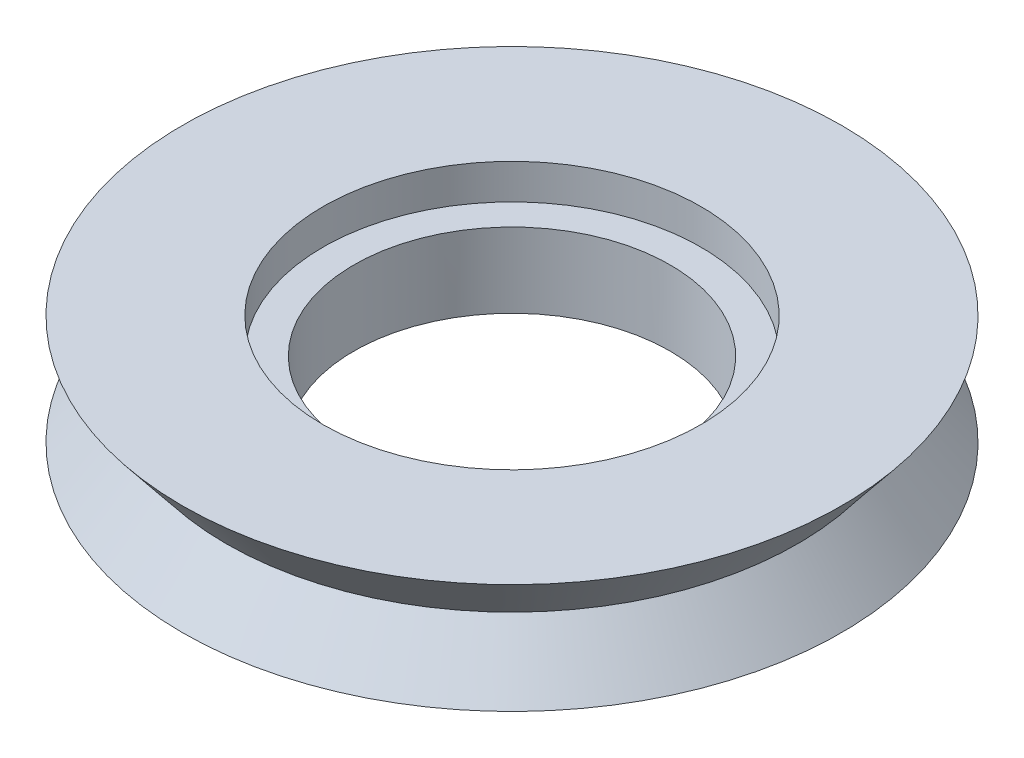
ISO-10303-21;
HEADER;
FILE_DESCRIPTION(('STEP AP214'),'2;1');
FILE_NAME('part.step','',(''),(''),'','','');
FILE_SCHEMA(('AUTOMOTIVE_DESIGN { 1 0 10303 214 1 1 1 1 }'));
ENDSEC;
DATA;
#1=APPLICATION_CONTEXT('core data for automotive mechanical design processes');
#2=APPLICATION_PROTOCOL_DEFINITION('international standard','automotive_design',2000,#1);
#3=PRODUCT_CONTEXT('',#1,'mechanical');
#4=PRODUCT('Part','Part','',(#3));
#5=PRODUCT_RELATED_PRODUCT_CATEGORY('part','',(#4));
#6=PRODUCT_DEFINITION_FORMATION('','',#4);
#7=PRODUCT_DEFINITION_CONTEXT('part definition',#1,'design');
#8=PRODUCT_DEFINITION('design','',#6,#7);
#9=PRODUCT_DEFINITION_SHAPE('','',#8);
#10=(LENGTH_UNIT() NAMED_UNIT(*) SI_UNIT(.MILLI.,.METRE.));
#11=(NAMED_UNIT(*) PLANE_ANGLE_UNIT() SI_UNIT($,.RADIAN.));
#12=(NAMED_UNIT(*) SI_UNIT($,.STERADIAN.) SOLID_ANGLE_UNIT());
#13=UNCERTAINTY_MEASURE_WITH_UNIT(LENGTH_MEASURE(1.E-05),#10,'distance_accuracy_value','');
#14=(GEOMETRIC_REPRESENTATION_CONTEXT(3) GLOBAL_UNCERTAINTY_ASSIGNED_CONTEXT((#13)) GLOBAL_UNIT_ASSIGNED_CONTEXT((#10,
#11,#12)) REPRESENTATION_CONTEXT('',''));
#15=CARTESIAN_POINT('',(0.,0.,0.));
#16=DIRECTION('',(0.,0.,1.));
#17=DIRECTION('',(1.,0.,0.));
#18=AXIS2_PLACEMENT_3D('',#15,#16,#17);
#19=CARTESIAN_POINT('',(0.,-10.1823376490863,0.));
#20=DIRECTION('',(0.,1.,0.));
#21=DIRECTION('',(0.,0.,1.));
#22=AXIS2_PLACEMENT_3D('',#19,#20,#21);
#23=CYLINDRICAL_SURFACE('',#22,3.6);
#24=CARTESIAN_POINT('',(0.,0.,0.));
#25=DIRECTION('',(0.,-1.,0.));
#26=DIRECTION('',(0.,0.,-1.));
#27=AXIS2_PLACEMENT_3D('',#24,#25,#26);
#28=CIRCLE('',#27,3.6);
#29=CARTESIAN_POINT('',(0.,0.,-3.6));
#30=VERTEX_POINT('',#29);
#31=EDGE_CURVE('E50',#30,#30,#28,.F.);
#32=ORIENTED_EDGE('',*,*,#31,.F.);
#33=EDGE_LOOP('',(#32));
#34=FACE_BOUND('',#33,.T.);
#35=CARTESIAN_POINT('',(0.,1.7,0.));
#36=DIRECTION('',(0.,1.,0.));
#37=DIRECTION('',(0.,0.,1.));
#38=AXIS2_PLACEMENT_3D('',#35,#36,#37);
#39=CIRCLE('',#38,3.6);
#40=CARTESIAN_POINT('',(0.,1.7,3.6));
#41=VERTEX_POINT('',#40);
#42=EDGE_CURVE('E37',#41,#41,#39,.F.);
#43=ORIENTED_EDGE('',*,*,#42,.F.);
#44=EDGE_LOOP('',(#43));
#45=FACE_BOUND('',#44,.T.);
#46=ADVANCED_FACE('F33',(#34,#45),#23,.F.);
#47=CARTESIAN_POINT('',(-7.5,0.,0.));
#48=DIRECTION('',(0.,-1.,0.));
#49=DIRECTION('',(0.,0.,-1.));
#50=AXIS2_PLACEMENT_3D('',#47,#48,#49);
#51=PLANE('',#50);
#52=ORIENTED_EDGE('',*,*,#31,.T.);
#53=EDGE_LOOP('',(#52));
#54=FACE_BOUND('',#53,.T.);
#55=CARTESIAN_POINT('',(0.,0.,0.));
#56=DIRECTION('',(0.,1.,0.));
#57=DIRECTION('',(0.,0.,1.));
#58=AXIS2_PLACEMENT_3D('',#55,#56,#57);
#59=CIRCLE('',#58,7.5);
#60=CARTESIAN_POINT('',(0.,0.,7.5));
#61=VERTEX_POINT('',#60);
#62=EDGE_CURVE('E45',#61,#61,#59,.T.);
#63=ORIENTED_EDGE('',*,*,#62,.F.);
#64=EDGE_LOOP('',(#63));
#65=FACE_BOUND('',#64,.T.);
#66=ADVANCED_FACE('F35',(#54,#65),#51,.T.);
#67=CARTESIAN_POINT('',(0.,2.5,0.));
#68=DIRECTION('',(0.,1.,0.));
#69=DIRECTION('',(0.,0.,1.));
#70=AXIS2_PLACEMENT_3D('',#67,#68,#69);
#71=PLANE('',#70);
#72=CARTESIAN_POINT('',(0.,2.5,0.));
#73=DIRECTION('',(0.,1.,0.));
#74=DIRECTION('',(0.,0.,1.));
#75=AXIS2_PLACEMENT_3D('',#72,#73,#74);
#76=CIRCLE('',#75,4.3);
#77=CARTESIAN_POINT('',(0.,2.5,4.3));
#78=VERTEX_POINT('',#77);
#79=EDGE_CURVE('E53',#78,#78,#76,.T.);
#80=ORIENTED_EDGE('',*,*,#79,.F.);
#81=EDGE_LOOP('',(#80));
#82=FACE_BOUND('',#81,.T.);
#83=CARTESIAN_POINT('',(0.,2.5,0.));
#84=DIRECTION('',(0.,1.,0.));
#85=DIRECTION('',(0.,0.,1.));
#86=AXIS2_PLACEMENT_3D('',#83,#84,#85);
#87=CIRCLE('',#86,7.5);
#88=CARTESIAN_POINT('',(0.,2.5,7.5));
#89=VERTEX_POINT('',#88);
#90=EDGE_CURVE('E10',#89,#89,#87,.T.);
#91=ORIENTED_EDGE('',*,*,#90,.T.);
#92=EDGE_LOOP('',(#91));
#93=FACE_BOUND('',#92,.T.);
#94=ADVANCED_FACE('F73',(#82,#93),#71,.T.);
#95=CARTESIAN_POINT('',(0.,2.5,0.));
#96=DIRECTION('',(0.,1.,0.));
#97=DIRECTION('',(0.,0.,1.));
#98=AXIS2_PLACEMENT_3D('',#95,#96,#97);
#99=CONICAL_SURFACE('',#98,7.5,0.674740942223553);
#100=CARTESIAN_POINT('',(0.,1.25,0.));
#101=DIRECTION('',(0.,1.,0.));
#102=DIRECTION('',(0.,0.,1.));
#103=AXIS2_PLACEMENT_3D('',#100,#101,#102);
#104=CIRCLE('',#103,6.5);
#105=CARTESIAN_POINT('',(0.,1.25,6.5));
#106=VERTEX_POINT('',#105);
#107=EDGE_CURVE('E41',#106,#106,#104,.T.);
#108=ORIENTED_EDGE('',*,*,#107,.T.);
#109=EDGE_LOOP('',(#108));
#110=FACE_BOUND('',#109,.T.);
#111=ORIENTED_EDGE('',*,*,#90,.F.);
#112=EDGE_LOOP('',(#111));
#113=FACE_BOUND('',#112,.T.);
#114=ADVANCED_FACE('F82',(#110,#113),#99,.T.);
#115=CARTESIAN_POINT('',(0.,1.25,0.));
#116=DIRECTION('',(0.,-1.,0.));
#117=DIRECTION('',(0.,0.,-1.));
#118=AXIS2_PLACEMENT_3D('',#115,#116,#117);
#119=CONICAL_SURFACE('',#118,6.5,0.674740942223553);
#120=ORIENTED_EDGE('',*,*,#62,.T.);
#121=EDGE_LOOP('',(#120));
#122=FACE_BOUND('',#121,.T.);
#123=ORIENTED_EDGE('',*,*,#107,.F.);
#124=EDGE_LOOP('',(#123));
#125=FACE_BOUND('',#124,.T.);
#126=ADVANCED_FACE('F80',(#122,#125),#119,.T.);
#127=CARTESIAN_POINT('',(0.,1.7,0.));
#128=DIRECTION('',(0.,1.,0.));
#129=DIRECTION('',(0.,0.,1.));
#130=AXIS2_PLACEMENT_3D('',#127,#128,#129);
#131=PLANE('',#130);
#132=CARTESIAN_POINT('',(0.,1.7,0.));
#133=DIRECTION('',(0.,1.,0.));
#134=DIRECTION('',(0.,0.,1.));
#135=AXIS2_PLACEMENT_3D('',#132,#133,#134);
#136=CIRCLE('',#135,4.3);
#137=CARTESIAN_POINT('',(0.,1.7,4.3));
#138=VERTEX_POINT('',#137);
#139=EDGE_CURVE('E56',#138,#138,#136,.T.);
#140=ORIENTED_EDGE('',*,*,#139,.T.);
#141=EDGE_LOOP('',(#140));
#142=FACE_BOUND('',#141,.T.);
#143=ORIENTED_EDGE('',*,*,#42,.T.);
#144=EDGE_LOOP('',(#143));
#145=FACE_BOUND('',#144,.T.);
#146=ADVANCED_FACE('F63',(#142,#145),#131,.T.);
#147=CARTESIAN_POINT('',(0.,1.7,0.));
#148=DIRECTION('',(0.,1.,0.));
#149=DIRECTION('',(0.,0.,1.));
#150=AXIS2_PLACEMENT_3D('',#147,#148,#149);
#151=CYLINDRICAL_SURFACE('',#150,4.3);
#152=ORIENTED_EDGE('',*,*,#139,.F.);
#153=EDGE_LOOP('',(#152));
#154=FACE_BOUND('',#153,.T.);
#155=ORIENTED_EDGE('',*,*,#79,.T.);
#156=EDGE_LOOP('',(#155));
#157=FACE_BOUND('',#156,.T.);
#158=ADVANCED_FACE('F78',(#154,#157),#151,.F.);
#159=CLOSED_SHELL('',(#46,#66,#94,#114,#126,#146,#158));
#160=MANIFOLD_SOLID_BREP('B2',#159);
#161=ADVANCED_BREP_SHAPE_REPRESENTATION('',(#18,#160),#14);
#162=SHAPE_DEFINITION_REPRESENTATION(#9,#161);
ENDSEC;
END-ISO-10303-21;
